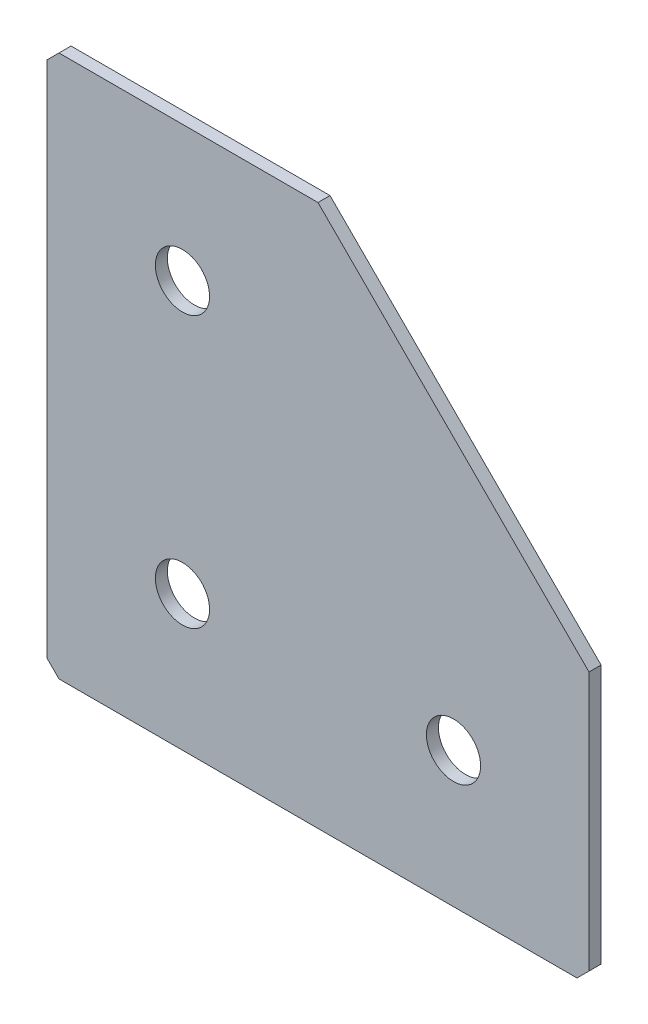
ISO-10303-21;
HEADER;
FILE_DESCRIPTION(('STEP AP214'),'2;1');
FILE_NAME('part.step','',(''),(''),'','','');
FILE_SCHEMA(('AUTOMOTIVE_DESIGN { 1 0 10303 214 1 1 1 1 }'));
ENDSEC;
DATA;
#1=APPLICATION_CONTEXT('core data for automotive mechanical design processes');
#2=APPLICATION_PROTOCOL_DEFINITION('international standard','automotive_design',2000,#1);
#3=PRODUCT_CONTEXT('',#1,'mechanical');
#4=PRODUCT('Part','Part','',(#3));
#5=PRODUCT_RELATED_PRODUCT_CATEGORY('part','',(#4));
#6=PRODUCT_DEFINITION_FORMATION('','',#4);
#7=PRODUCT_DEFINITION_CONTEXT('part definition',#1,'design');
#8=PRODUCT_DEFINITION('design','',#6,#7);
#9=PRODUCT_DEFINITION_SHAPE('','',#8);
#10=(LENGTH_UNIT() NAMED_UNIT(*) SI_UNIT(.MILLI.,.METRE.));
#11=(NAMED_UNIT(*) PLANE_ANGLE_UNIT() SI_UNIT($,.RADIAN.));
#12=(NAMED_UNIT(*) SI_UNIT($,.STERADIAN.) SOLID_ANGLE_UNIT());
#13=UNCERTAINTY_MEASURE_WITH_UNIT(LENGTH_MEASURE(1.E-05),#10,'distance_accuracy_value','');
#14=(GEOMETRIC_REPRESENTATION_CONTEXT(3) GLOBAL_UNCERTAINTY_ASSIGNED_CONTEXT((#13)) GLOBAL_UNIT_ASSIGNED_CONTEXT((#10,
#11,#12)) REPRESENTATION_CONTEXT('',''));
#15=CARTESIAN_POINT('',(0.,0.,0.));
#16=DIRECTION('',(0.,0.,1.));
#17=DIRECTION('',(1.,0.,0.));
#18=AXIS2_PLACEMENT_3D('',#15,#16,#17);
#19=CARTESIAN_POINT('',(45.,0.,-2.));
#20=DIRECTION('',(0.,-1.,0.));
#21=DIRECTION('',(1.,0.,0.));
#22=AXIS2_PLACEMENT_3D('',#19,#20,#21);
#23=PLANE('',#22);
#24=DIRECTION('',(1.,0.,0.));
#25=VECTOR('',#24,1.);
#26=CARTESIAN_POINT('',(45.,0.,-2.));
#27=LINE('',#26,#25);
#28=CARTESIAN_POINT('',(2.00000000000003,0.,-2.));
#29=VERTEX_POINT('',#28);
#30=CARTESIAN_POINT('',(45.,0.,-2.));
#31=VERTEX_POINT('',#30);
#32=EDGE_CURVE('E101',#29,#31,#27,.T.);
#33=ORIENTED_EDGE('',*,*,#32,.F.);
#34=DIRECTION('',(0.,0.,1.));
#35=VECTOR('',#34,1.);
#36=CARTESIAN_POINT('',(2.00000000000002,0.,-2.));
#37=LINE('',#36,#35);
#38=CARTESIAN_POINT('',(2.00000000000003,0.,0.));
#39=VERTEX_POINT('',#38);
#40=EDGE_CURVE('E127',#29,#39,#37,.T.);
#41=ORIENTED_EDGE('',*,*,#40,.T.);
#42=DIRECTION('',(1.,0.,0.));
#43=VECTOR('',#42,1.);
#44=CARTESIAN_POINT('',(45.,0.,0.));
#45=LINE('',#44,#43);
#46=CARTESIAN_POINT('',(45.,0.,0.));
#47=VERTEX_POINT('',#46);
#48=EDGE_CURVE('E125',#39,#47,#45,.T.);
#49=ORIENTED_EDGE('',*,*,#48,.T.);
#50=DIRECTION('',(0.,0.,1.));
#51=VECTOR('',#50,1.);
#52=CARTESIAN_POINT('',(45.,0.,-2.));
#53=LINE('',#52,#51);
#54=EDGE_CURVE('E118',#31,#47,#53,.T.);
#55=ORIENTED_EDGE('',*,*,#54,.F.);
#56=EDGE_LOOP('',(#33,#41,#49,#55));
#57=FACE_BOUND('',#56,.T.);
#58=ADVANCED_FACE('F37',(#57),#23,.F.);
#59=CARTESIAN_POINT('',(90.,-45.,-2.));
#60=DIRECTION('',(-0.707106781186547,-0.707106781186547,0.));
#61=DIRECTION('',(0.707106781186548,-0.707106781186548,0.));
#62=AXIS2_PLACEMENT_3D('',#59,#60,#61);
#63=PLANE('',#62);
#64=DIRECTION('',(0.707106781186548,-0.707106781186548,0.));
#65=VECTOR('',#64,1.);
#66=CARTESIAN_POINT('',(90.,-45.,0.));
#67=LINE('',#66,#65);
#68=CARTESIAN_POINT('',(90.,-45.,0.));
#69=VERTEX_POINT('',#68);
#70=EDGE_CURVE('E164',#47,#69,#67,.T.);
#71=ORIENTED_EDGE('',*,*,#70,.T.);
#72=DIRECTION('',(0.,0.,1.));
#73=VECTOR('',#72,1.);
#74=CARTESIAN_POINT('',(90.,-45.,-2.));
#75=LINE('',#74,#73);
#76=CARTESIAN_POINT('',(90.,-45.,-2.));
#77=VERTEX_POINT('',#76);
#78=EDGE_CURVE('E120',#77,#69,#75,.T.);
#79=ORIENTED_EDGE('',*,*,#78,.F.);
#80=DIRECTION('',(0.707106781186548,-0.707106781186548,0.));
#81=VECTOR('',#80,1.);
#82=CARTESIAN_POINT('',(90.,-45.,-2.));
#83=LINE('',#82,#81);
#84=EDGE_CURVE('E105',#31,#77,#83,.T.);
#85=ORIENTED_EDGE('',*,*,#84,.F.);
#86=ORIENTED_EDGE('',*,*,#54,.T.);
#87=EDGE_LOOP('',(#71,#79,#85,#86));
#88=FACE_BOUND('',#87,.T.);
#89=ADVANCED_FACE('F117',(#88),#63,.F.);
#90=CARTESIAN_POINT('',(90.,-90.,-2.));
#91=DIRECTION('',(-1.,0.,0.));
#92=DIRECTION('',(0.,0.,1.));
#93=AXIS2_PLACEMENT_3D('',#90,#91,#92);
#94=PLANE('',#93);
#95=DIRECTION('',(0.,-1.,0.));
#96=VECTOR('',#95,1.);
#97=CARTESIAN_POINT('',(90.,-90.,0.));
#98=LINE('',#97,#96);
#99=CARTESIAN_POINT('',(90.,-88.,0.));
#100=VERTEX_POINT('',#99);
#101=EDGE_CURVE('E161',#69,#100,#98,.T.);
#102=ORIENTED_EDGE('',*,*,#101,.T.);
#103=DIRECTION('',(0.,0.,-1.));
#104=VECTOR('',#103,1.);
#105=CARTESIAN_POINT('',(90.,-88.,-2.));
#106=LINE('',#105,#104);
#107=CARTESIAN_POINT('',(90.,-88.,-2.));
#108=VERTEX_POINT('',#107);
#109=EDGE_CURVE('E11',#100,#108,#106,.T.);
#110=ORIENTED_EDGE('',*,*,#109,.T.);
#111=DIRECTION('',(0.,-1.,0.));
#112=VECTOR('',#111,1.);
#113=CARTESIAN_POINT('',(90.,-90.,-2.));
#114=LINE('',#113,#112);
#115=EDGE_CURVE('E122',#77,#108,#114,.T.);
#116=ORIENTED_EDGE('',*,*,#115,.F.);
#117=ORIENTED_EDGE('',*,*,#78,.T.);
#118=EDGE_LOOP('',(#102,#110,#116,#117));
#119=FACE_BOUND('',#118,.T.);
#120=ADVANCED_FACE('F220',(#119),#94,.F.);
#121=CARTESIAN_POINT('',(0.,-90.,-2.));
#122=DIRECTION('',(0.,1.,0.));
#123=DIRECTION('',(0.,0.,1.));
#124=AXIS2_PLACEMENT_3D('',#121,#122,#123);
#125=PLANE('',#124);
#126=DIRECTION('',(-1.,0.,0.));
#127=VECTOR('',#126,1.);
#128=CARTESIAN_POINT('',(0.,-90.,-2.));
#129=LINE('',#128,#127);
#130=CARTESIAN_POINT('',(88.,-90.,-2.));
#131=VERTEX_POINT('',#130);
#132=CARTESIAN_POINT('',(2.,-90.,-2.));
#133=VERTEX_POINT('',#132);
#134=EDGE_CURVE('E154',#131,#133,#129,.T.);
#135=ORIENTED_EDGE('',*,*,#134,.F.);
#136=DIRECTION('',(0.,0.,1.));
#137=VECTOR('',#136,1.);
#138=CARTESIAN_POINT('',(88.,-90.,-2.));
#139=LINE('',#138,#137);
#140=CARTESIAN_POINT('',(88.,-90.,0.));
#141=VERTEX_POINT('',#140);
#142=EDGE_CURVE('E45',#131,#141,#139,.T.);
#143=ORIENTED_EDGE('',*,*,#142,.T.);
#144=DIRECTION('',(-1.,0.,0.));
#145=VECTOR('',#144,1.);
#146=CARTESIAN_POINT('',(0.,-90.,0.));
#147=LINE('',#146,#145);
#148=CARTESIAN_POINT('',(2.,-90.,0.));
#149=VERTEX_POINT('',#148);
#150=EDGE_CURVE('E153',#141,#149,#147,.T.);
#151=ORIENTED_EDGE('',*,*,#150,.T.);
#152=DIRECTION('',(0.,0.,-1.));
#153=VECTOR('',#152,1.);
#154=CARTESIAN_POINT('',(2.,-90.,-2.));
#155=LINE('',#154,#153);
#156=EDGE_CURVE('E52',#149,#133,#155,.T.);
#157=ORIENTED_EDGE('',*,*,#156,.T.);
#158=EDGE_LOOP('',(#135,#143,#151,#157));
#159=FACE_BOUND('',#158,.T.);
#160=ADVANCED_FACE('F152',(#159),#125,.F.);
#161=CARTESIAN_POINT('',(0.,0.,-2.));
#162=DIRECTION('',(1.,0.,0.));
#163=DIRECTION('',(0.,0.,-1.));
#164=AXIS2_PLACEMENT_3D('',#161,#162,#163);
#165=PLANE('',#164);
#166=DIRECTION('',(0.,1.,0.));
#167=VECTOR('',#166,1.);
#168=CARTESIAN_POINT('',(0.,0.,0.));
#169=LINE('',#168,#167);
#170=CARTESIAN_POINT('',(0.,-88.,0.));
#171=VERTEX_POINT('',#170);
#172=CARTESIAN_POINT('',(0.,-2.00000000000001,0.));
#173=VERTEX_POINT('',#172);
#174=EDGE_CURVE('E113',#171,#173,#169,.T.);
#175=ORIENTED_EDGE('',*,*,#174,.T.);
#176=DIRECTION('',(0.,0.,-1.));
#177=VECTOR('',#176,1.);
#178=CARTESIAN_POINT('',(0.,-2.00000000000002,-2.));
#179=LINE('',#178,#177);
#180=CARTESIAN_POINT('',(0.,-2.00000000000001,-2.));
#181=VERTEX_POINT('',#180);
#182=EDGE_CURVE('E143',#173,#181,#179,.T.);
#183=ORIENTED_EDGE('',*,*,#182,.T.);
#184=DIRECTION('',(0.,1.,0.));
#185=VECTOR('',#184,1.);
#186=CARTESIAN_POINT('',(0.,0.,-2.));
#187=LINE('',#186,#185);
#188=CARTESIAN_POINT('',(0.,-88.,-2.));
#189=VERTEX_POINT('',#188);
#190=EDGE_CURVE('E131',#189,#181,#187,.T.);
#191=ORIENTED_EDGE('',*,*,#190,.F.);
#192=DIRECTION('',(0.,0.,1.));
#193=VECTOR('',#192,1.);
#194=CARTESIAN_POINT('',(0.,-88.,-2.));
#195=LINE('',#194,#193);
#196=EDGE_CURVE('E140',#189,#171,#195,.T.);
#197=ORIENTED_EDGE('',*,*,#196,.T.);
#198=EDGE_LOOP('',(#175,#183,#191,#197));
#199=FACE_BOUND('',#198,.T.);
#200=ADVANCED_FACE('F195',(#199),#165,.F.);
#201=CARTESIAN_POINT('',(0.,0.,-2.));
#202=DIRECTION('',(0.,0.,1.));
#203=DIRECTION('',(1.,0.,0.));
#204=AXIS2_PLACEMENT_3D('',#201,#202,#203);
#205=PLANE('',#204);
#206=CARTESIAN_POINT('',(22.5,-67.5,-2.));
#207=DIRECTION('',(0.,0.,-1.));
#208=DIRECTION('',(0.,1.,0.));
#209=AXIS2_PLACEMENT_3D('',#206,#207,#208);
#210=CIRCLE('',#209,4.5);
#211=CARTESIAN_POINT('',(22.5,-63.,-2.));
#212=VERTEX_POINT('',#211);
#213=EDGE_CURVE('E187',#212,#212,#210,.T.);
#214=ORIENTED_EDGE('',*,*,#213,.F.);
#215=EDGE_LOOP('',(#214));
#216=FACE_BOUND('',#215,.T.);
#217=CARTESIAN_POINT('',(22.5,-22.5,-2.));
#218=DIRECTION('',(0.,0.,-1.));
#219=DIRECTION('',(0.,1.,0.));
#220=AXIS2_PLACEMENT_3D('',#217,#218,#219);
#221=CIRCLE('',#220,4.5);
#222=CARTESIAN_POINT('',(22.5,-18.,-2.));
#223=VERTEX_POINT('',#222);
#224=EDGE_CURVE('E181',#223,#223,#221,.T.);
#225=ORIENTED_EDGE('',*,*,#224,.F.);
#226=EDGE_LOOP('',(#225));
#227=FACE_BOUND('',#226,.T.);
#228=CARTESIAN_POINT('',(67.5,-67.5,-2.));
#229=DIRECTION('',(0.,0.,-1.));
#230=DIRECTION('',(0.,1.,0.));
#231=AXIS2_PLACEMENT_3D('',#228,#229,#230);
#232=CIRCLE('',#231,4.5);
#233=CARTESIAN_POINT('',(67.5,-63.,-2.));
#234=VERTEX_POINT('',#233);
#235=EDGE_CURVE('E175',#234,#234,#232,.T.);
#236=ORIENTED_EDGE('',*,*,#235,.F.);
#237=EDGE_LOOP('',(#236));
#238=FACE_BOUND('',#237,.T.);
#239=ORIENTED_EDGE('',*,*,#190,.T.);
#240=DIRECTION('',(-0.707106781186548,-0.707106781186548,0.));
#241=VECTOR('',#240,1.);
#242=CARTESIAN_POINT('',(2.00000000000002,0.,-2.));
#243=LINE('',#242,#241);
#244=EDGE_CURVE('E108',#181,#29,#243,.F.);
#245=ORIENTED_EDGE('',*,*,#244,.T.);
#246=ORIENTED_EDGE('',*,*,#32,.T.);
#247=ORIENTED_EDGE('',*,*,#84,.T.);
#248=ORIENTED_EDGE('',*,*,#115,.T.);
#249=DIRECTION('',(0.707106781186545,0.70710678118655,0.));
#250=VECTOR('',#249,1.);
#251=CARTESIAN_POINT('',(88.,-90.,-2.));
#252=LINE('',#251,#250);
#253=EDGE_CURVE('E59',#108,#131,#252,.F.);
#254=ORIENTED_EDGE('',*,*,#253,.T.);
#255=ORIENTED_EDGE('',*,*,#134,.T.);
#256=DIRECTION('',(0.70710678118655,-0.707106781186545,0.));
#257=VECTOR('',#256,1.);
#258=CARTESIAN_POINT('',(0.,-88.,-2.));
#259=LINE('',#258,#257);
#260=EDGE_CURVE('E145',#133,#189,#259,.F.);
#261=ORIENTED_EDGE('',*,*,#260,.T.);
#262=EDGE_LOOP('',(#239,#245,#246,#247,#248,#254,#255,#261));
#263=FACE_BOUND('',#262,.T.);
#264=ADVANCED_FACE('F104',(#216,#227,#238,#263),#205,.F.);
#265=CARTESIAN_POINT('',(0.,0.,0.));
#266=DIRECTION('',(0.,0.,1.));
#267=DIRECTION('',(1.,0.,0.));
#268=AXIS2_PLACEMENT_3D('',#265,#266,#267);
#269=PLANE('',#268);
#270=CARTESIAN_POINT('',(22.5,-67.5,0.));
#271=DIRECTION('',(0.,0.,-1.));
#272=DIRECTION('',(0.,1.,0.));
#273=AXIS2_PLACEMENT_3D('',#270,#271,#272);
#274=CIRCLE('',#273,4.5);
#275=CARTESIAN_POINT('',(22.5,-63.,0.));
#276=VERTEX_POINT('',#275);
#277=EDGE_CURVE('E184',#276,#276,#274,.T.);
#278=ORIENTED_EDGE('',*,*,#277,.T.);
#279=EDGE_LOOP('',(#278));
#280=FACE_BOUND('',#279,.T.);
#281=CARTESIAN_POINT('',(22.5,-22.5,0.));
#282=DIRECTION('',(0.,0.,-1.));
#283=DIRECTION('',(0.,1.,0.));
#284=AXIS2_PLACEMENT_3D('',#281,#282,#283);
#285=CIRCLE('',#284,4.5);
#286=CARTESIAN_POINT('',(22.5,-18.,0.));
#287=VERTEX_POINT('',#286);
#288=EDGE_CURVE('E178',#287,#287,#285,.T.);
#289=ORIENTED_EDGE('',*,*,#288,.T.);
#290=EDGE_LOOP('',(#289));
#291=FACE_BOUND('',#290,.T.);
#292=CARTESIAN_POINT('',(67.5,-67.5,0.));
#293=DIRECTION('',(0.,0.,-1.));
#294=DIRECTION('',(0.,1.,0.));
#295=AXIS2_PLACEMENT_3D('',#292,#293,#294);
#296=CIRCLE('',#295,4.5);
#297=CARTESIAN_POINT('',(67.5,-63.,0.));
#298=VERTEX_POINT('',#297);
#299=EDGE_CURVE('E169',#298,#298,#296,.T.);
#300=ORIENTED_EDGE('',*,*,#299,.T.);
#301=EDGE_LOOP('',(#300));
#302=FACE_BOUND('',#301,.T.);
#303=ORIENTED_EDGE('',*,*,#48,.F.);
#304=DIRECTION('',(0.707106781186548,0.707106781186548,0.));
#305=VECTOR('',#304,1.);
#306=CARTESIAN_POINT('',(1.00000000000001,-1.00000000000001,0.));
#307=LINE('',#306,#305);
#308=EDGE_CURVE('E138',#39,#173,#307,.F.);
#309=ORIENTED_EDGE('',*,*,#308,.T.);
#310=ORIENTED_EDGE('',*,*,#174,.F.);
#311=DIRECTION('',(-0.70710678118655,0.707106781186545,0.));
#312=VECTOR('',#311,1.);
#313=CARTESIAN_POINT('',(-44.,-44.0000000000003,0.));
#314=LINE('',#313,#312);
#315=EDGE_CURVE('E129',#171,#149,#314,.F.);
#316=ORIENTED_EDGE('',*,*,#315,.T.);
#317=ORIENTED_EDGE('',*,*,#150,.F.);
#318=DIRECTION('',(-0.707106781186545,-0.70710678118655,0.));
#319=VECTOR('',#318,1.);
#320=CARTESIAN_POINT('',(89.0000000000003,-88.9999999999997,0.));
#321=LINE('',#320,#319);
#322=EDGE_CURVE('E136',#141,#100,#321,.F.);
#323=ORIENTED_EDGE('',*,*,#322,.T.);
#324=ORIENTED_EDGE('',*,*,#101,.F.);
#325=ORIENTED_EDGE('',*,*,#70,.F.);
#326=EDGE_LOOP('',(#303,#309,#310,#316,#317,#323,#324,#325));
#327=FACE_BOUND('',#326,.T.);
#328=ADVANCED_FACE('F157',(#280,#291,#302,#327),#269,.T.);
#329=CARTESIAN_POINT('',(67.5,-67.5,-2.));
#330=DIRECTION('',(0.,0.,-1.));
#331=DIRECTION('',(0.,1.,0.));
#332=AXIS2_PLACEMENT_3D('',#329,#330,#331);
#333=CYLINDRICAL_SURFACE('',#332,4.5);
#334=ORIENTED_EDGE('',*,*,#299,.F.);
#335=EDGE_LOOP('',(#334));
#336=FACE_BOUND('',#335,.T.);
#337=ORIENTED_EDGE('',*,*,#235,.T.);
#338=EDGE_LOOP('',(#337));
#339=FACE_BOUND('',#338,.T.);
#340=ADVANCED_FACE('F201',(#336,#339),#333,.F.);
#341=CARTESIAN_POINT('',(22.5,-22.5,-2.));
#342=DIRECTION('',(0.,0.,-1.));
#343=DIRECTION('',(0.,1.,0.));
#344=AXIS2_PLACEMENT_3D('',#341,#342,#343);
#345=CYLINDRICAL_SURFACE('',#344,4.5);
#346=ORIENTED_EDGE('',*,*,#288,.F.);
#347=EDGE_LOOP('',(#346));
#348=FACE_BOUND('',#347,.T.);
#349=ORIENTED_EDGE('',*,*,#224,.T.);
#350=EDGE_LOOP('',(#349));
#351=FACE_BOUND('',#350,.T.);
#352=ADVANCED_FACE('F203',(#348,#351),#345,.F.);
#353=CARTESIAN_POINT('',(22.5,-67.5,-2.));
#354=DIRECTION('',(0.,0.,-1.));
#355=DIRECTION('',(0.,1.,0.));
#356=AXIS2_PLACEMENT_3D('',#353,#354,#355);
#357=CYLINDRICAL_SURFACE('',#356,4.5);
#358=ORIENTED_EDGE('',*,*,#277,.F.);
#359=EDGE_LOOP('',(#358));
#360=FACE_BOUND('',#359,.T.);
#361=ORIENTED_EDGE('',*,*,#213,.T.);
#362=EDGE_LOOP('',(#361));
#363=FACE_BOUND('',#362,.T.);
#364=ADVANCED_FACE('F191',(#360,#363),#357,.F.);
#365=CARTESIAN_POINT('',(2.00000000000002,0.,-2.));
#366=DIRECTION('',(0.707106781186547,-0.707106781186547,0.));
#367=DIRECTION('',(0.,0.,1.));
#368=AXIS2_PLACEMENT_3D('',#365,#366,#367);
#369=PLANE('',#368);
#370=ORIENTED_EDGE('',*,*,#244,.F.);
#371=ORIENTED_EDGE('',*,*,#182,.F.);
#372=ORIENTED_EDGE('',*,*,#308,.F.);
#373=ORIENTED_EDGE('',*,*,#40,.F.);
#374=EDGE_LOOP('',(#370,#371,#372,#373));
#375=FACE_BOUND('',#374,.T.);
#376=ADVANCED_FACE('F224',(#375),#369,.F.);
#377=CARTESIAN_POINT('',(88.,-90.,-2.));
#378=DIRECTION('',(-0.70710678118655,0.707106781186545,0.));
#379=DIRECTION('',(0.,0.,1.));
#380=AXIS2_PLACEMENT_3D('',#377,#378,#379);
#381=PLANE('',#380);
#382=ORIENTED_EDGE('',*,*,#253,.F.);
#383=ORIENTED_EDGE('',*,*,#109,.F.);
#384=ORIENTED_EDGE('',*,*,#322,.F.);
#385=ORIENTED_EDGE('',*,*,#142,.F.);
#386=EDGE_LOOP('',(#382,#383,#384,#385));
#387=FACE_BOUND('',#386,.T.);
#388=ADVANCED_FACE('F226',(#387),#381,.F.);
#389=CARTESIAN_POINT('',(0.,-88.,-2.));
#390=DIRECTION('',(0.707106781186545,0.70710678118655,0.));
#391=DIRECTION('',(0.,0.,1.));
#392=AXIS2_PLACEMENT_3D('',#389,#390,#391);
#393=PLANE('',#392);
#394=ORIENTED_EDGE('',*,*,#260,.F.);
#395=ORIENTED_EDGE('',*,*,#156,.F.);
#396=ORIENTED_EDGE('',*,*,#315,.F.);
#397=ORIENTED_EDGE('',*,*,#196,.F.);
#398=EDGE_LOOP('',(#394,#395,#396,#397));
#399=FACE_BOUND('',#398,.T.);
#400=ADVANCED_FACE('F39',(#399),#393,.F.);
#401=CLOSED_SHELL('',(#58,#89,#120,#160,#200,#264,#328,#340,#352,#364,#376,#388,#400));
#402=MANIFOLD_SOLID_BREP('B2',#401);
#403=ADVANCED_BREP_SHAPE_REPRESENTATION('',(#18,#402),#14);
#404=SHAPE_DEFINITION_REPRESENTATION(#9,#403);
ENDSEC;
END-ISO-10303-21;
